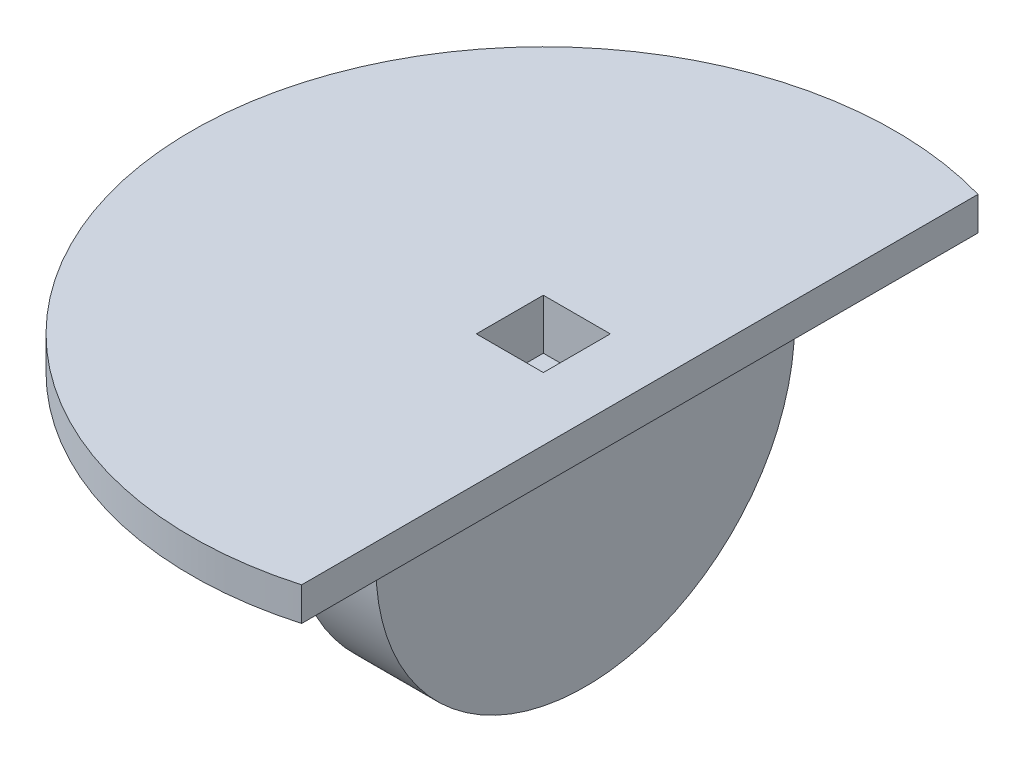
ISO-10303-21;
HEADER;
FILE_DESCRIPTION(('STEP AP214'),'2;1');
FILE_NAME('part.step','',(''),(''),'','','');
FILE_SCHEMA(('AUTOMOTIVE_DESIGN { 1 0 10303 214 1 1 1 1 }'));
ENDSEC;
DATA;
#1=APPLICATION_CONTEXT('core data for automotive mechanical design processes');
#2=APPLICATION_PROTOCOL_DEFINITION('international standard','automotive_design',2000,#1);
#3=PRODUCT_CONTEXT('',#1,'mechanical');
#4=PRODUCT('Part','Part','',(#3));
#5=PRODUCT_RELATED_PRODUCT_CATEGORY('part','',(#4));
#6=PRODUCT_DEFINITION_FORMATION('','',#4);
#7=PRODUCT_DEFINITION_CONTEXT('part definition',#1,'design');
#8=PRODUCT_DEFINITION('design','',#6,#7);
#9=PRODUCT_DEFINITION_SHAPE('','',#8);
#10=(LENGTH_UNIT() NAMED_UNIT(*) SI_UNIT(.MILLI.,.METRE.));
#11=(NAMED_UNIT(*) PLANE_ANGLE_UNIT() SI_UNIT($,.RADIAN.));
#12=(NAMED_UNIT(*) SI_UNIT($,.STERADIAN.) SOLID_ANGLE_UNIT());
#13=UNCERTAINTY_MEASURE_WITH_UNIT(LENGTH_MEASURE(1.E-05),#10,'distance_accuracy_value','');
#14=(GEOMETRIC_REPRESENTATION_CONTEXT(3) GLOBAL_UNCERTAINTY_ASSIGNED_CONTEXT((#13)) GLOBAL_UNIT_ASSIGNED_CONTEXT((#10,
#11,#12)) REPRESENTATION_CONTEXT('',''));
#15=CARTESIAN_POINT('',(0.,0.,0.));
#16=DIRECTION('',(0.,0.,1.));
#17=DIRECTION('',(1.,0.,0.));
#18=AXIS2_PLACEMENT_3D('',#15,#16,#17);
#19=CARTESIAN_POINT('',(-2.5,-2.5,0.));
#20=DIRECTION('',(1.,0.,0.));
#21=DIRECTION('',(0.,0.,-1.));
#22=AXIS2_PLACEMENT_3D('',#19,#20,#21);
#23=CYLINDRICAL_SURFACE('',#22,12.5);
#24=DIRECTION('',(1.,0.,0.));
#25=VECTOR('',#24,1.);
#26=CARTESIAN_POINT('',(2.5,-2.5,12.5));
#27=LINE('',#26,#25);
#28=CARTESIAN_POINT('',(-2.5,-2.5,12.5));
#29=VERTEX_POINT('',#28);
#30=CARTESIAN_POINT('',(2.5,-2.5,12.5));
#31=VERTEX_POINT('',#30);
#32=EDGE_CURVE('E184',#29,#31,#27,.T.);
#33=ORIENTED_EDGE('',*,*,#32,.F.);
#34=CARTESIAN_POINT('',(-2.5,-2.5,0.));
#35=DIRECTION('',(-1.,0.,0.));
#36=DIRECTION('',(0.,0.,1.));
#37=AXIS2_PLACEMENT_3D('',#34,#35,#36);
#38=CIRCLE('',#37,12.5);
#39=CARTESIAN_POINT('',(-2.5,-2.5,-12.5));
#40=VERTEX_POINT('',#39);
#41=EDGE_CURVE('E43',#40,#29,#38,.T.);
#42=ORIENTED_EDGE('',*,*,#41,.F.);
#43=DIRECTION('',(1.,0.,0.));
#44=VECTOR('',#43,1.);
#45=CARTESIAN_POINT('',(2.5,-2.5,-12.5));
#46=LINE('',#45,#44);
#47=CARTESIAN_POINT('',(2.5,-2.5,-12.5));
#48=VERTEX_POINT('',#47);
#49=EDGE_CURVE('E187',#48,#40,#46,.F.);
#50=ORIENTED_EDGE('',*,*,#49,.F.);
#51=CARTESIAN_POINT('',(2.5,-2.5,0.));
#52=DIRECTION('',(1.,0.,0.));
#53=DIRECTION('',(0.,0.,-1.));
#54=AXIS2_PLACEMENT_3D('',#51,#52,#53);
#55=CIRCLE('',#54,12.5);
#56=EDGE_CURVE('E11',#31,#48,#55,.T.);
#57=ORIENTED_EDGE('',*,*,#56,.F.);
#58=EDGE_LOOP('',(#33,#42,#50,#57));
#59=FACE_BOUND('',#58,.T.);
#60=ADVANCED_FACE('F35',(#59),#23,.T.);
#61=CARTESIAN_POINT('',(0.,2.,0.));
#62=DIRECTION('',(0.,-1.,0.));
#63=DIRECTION('',(0.,0.,-1.));
#64=AXIS2_PLACEMENT_3D('',#61,#62,#63);
#65=CYLINDRICAL_SURFACE('',#64,21.);
#66=CARTESIAN_POINT('',(0.,0.,0.));
#67=DIRECTION('',(0.,1.,0.));
#68=DIRECTION('',(0.,0.,1.));
#69=AXIS2_PLACEMENT_3D('',#66,#67,#68);
#70=CIRCLE('',#69,21.);
#71=CARTESIAN_POINT('',(5.76040185571511,0.,-20.1944985196631));
#72=VERTEX_POINT('',#71);
#73=CARTESIAN_POINT('',(5.76040185571511,0.,20.1944985196631));
#74=VERTEX_POINT('',#73);
#75=EDGE_CURVE('E164',#72,#74,#70,.T.);
#76=ORIENTED_EDGE('',*,*,#75,.T.);
#77=DIRECTION('',(0.,-1.,0.));
#78=VECTOR('',#77,1.);
#79=CARTESIAN_POINT('',(5.76040185571511,2.,20.1944985196631));
#80=LINE('',#79,#78);
#81=CARTESIAN_POINT('',(5.76040185571511,2.,20.1944985196631));
#82=VERTEX_POINT('',#81);
#83=EDGE_CURVE('E182',#82,#74,#80,.T.);
#84=ORIENTED_EDGE('',*,*,#83,.F.);
#85=CARTESIAN_POINT('',(0.,2.,0.));
#86=DIRECTION('',(0.,1.,0.));
#87=DIRECTION('',(0.,0.,1.));
#88=AXIS2_PLACEMENT_3D('',#85,#86,#87);
#89=CIRCLE('',#88,21.);
#90=CARTESIAN_POINT('',(5.76040185571511,2.,-20.1944985196631));
#91=VERTEX_POINT('',#90);
#92=EDGE_CURVE('E170',#91,#82,#89,.T.);
#93=ORIENTED_EDGE('',*,*,#92,.F.);
#94=DIRECTION('',(0.,-1.,0.));
#95=VECTOR('',#94,1.);
#96=CARTESIAN_POINT('',(5.76040185571511,2.,-20.1944985196631));
#97=LINE('',#96,#95);
#98=EDGE_CURVE('E176',#91,#72,#97,.T.);
#99=ORIENTED_EDGE('',*,*,#98,.T.);
#100=EDGE_LOOP('',(#76,#84,#93,#99));
#101=FACE_BOUND('',#100,.T.);
#102=ADVANCED_FACE('F219',(#101),#65,.T.);
#103=CARTESIAN_POINT('',(5.76040185571511,2.,-20.1944985196631));
#104=DIRECTION('',(1.,0.,0.));
#105=DIRECTION('',(0.,0.,-1.));
#106=AXIS2_PLACEMENT_3D('',#103,#104,#105);
#107=PLANE('',#106);
#108=DIRECTION('',(0.,0.,1.));
#109=VECTOR('',#108,1.);
#110=CARTESIAN_POINT('',(5.76040185571511,0.,-20.1944985196631));
#111=LINE('',#110,#109);
#112=EDGE_CURVE('E173',#72,#74,#111,.T.);
#113=ORIENTED_EDGE('',*,*,#112,.F.);
#114=ORIENTED_EDGE('',*,*,#98,.F.);
#115=DIRECTION('',(0.,0.,1.));
#116=VECTOR('',#115,1.);
#117=CARTESIAN_POINT('',(5.76040185571511,2.,-20.1944985196631));
#118=LINE('',#117,#116);
#119=EDGE_CURVE('E172',#91,#82,#118,.T.);
#120=ORIENTED_EDGE('',*,*,#119,.T.);
#121=ORIENTED_EDGE('',*,*,#83,.T.);
#122=EDGE_LOOP('',(#113,#114,#120,#121));
#123=FACE_BOUND('',#122,.T.);
#124=ADVANCED_FACE('F223',(#123),#107,.T.);
#125=CARTESIAN_POINT('',(0.,2.,0.));
#126=DIRECTION('',(0.,1.,0.));
#127=DIRECTION('',(0.,0.,1.));
#128=AXIS2_PLACEMENT_3D('',#125,#126,#127);
#129=PLANE('',#128);
#130=DIRECTION('',(0.,0.,1.));
#131=VECTOR('',#130,1.);
#132=CARTESIAN_POINT('',(-2.,2.,-2.));
#133=LINE('',#132,#131);
#134=CARTESIAN_POINT('',(-2.,2.,-2.));
#135=VERTEX_POINT('',#134);
#136=CARTESIAN_POINT('',(-2.,2.,2.));
#137=VERTEX_POINT('',#136);
#138=EDGE_CURVE('E50',#135,#137,#133,.T.);
#139=ORIENTED_EDGE('',*,*,#138,.F.);
#140=DIRECTION('',(-1.,0.,0.));
#141=VECTOR('',#140,1.);
#142=CARTESIAN_POINT('',(-2.,2.,-2.));
#143=LINE('',#142,#141);
#144=CARTESIAN_POINT('',(2.,2.,-2.));
#145=VERTEX_POINT('',#144);
#146=EDGE_CURVE('E131',#145,#135,#143,.T.);
#147=ORIENTED_EDGE('',*,*,#146,.F.);
#148=DIRECTION('',(0.,0.,-1.));
#149=VECTOR('',#148,1.);
#150=CARTESIAN_POINT('',(2.,2.,-2.));
#151=LINE('',#150,#149);
#152=CARTESIAN_POINT('',(2.,2.,2.));
#153=VERTEX_POINT('',#152);
#154=EDGE_CURVE('E134',#153,#145,#151,.T.);
#155=ORIENTED_EDGE('',*,*,#154,.F.);
#156=DIRECTION('',(1.,0.,0.));
#157=VECTOR('',#156,1.);
#158=CARTESIAN_POINT('',(-2.,2.,2.));
#159=LINE('',#158,#157);
#160=EDGE_CURVE('E140',#137,#153,#159,.T.);
#161=ORIENTED_EDGE('',*,*,#160,.F.);
#162=EDGE_LOOP('',(#139,#147,#155,#161));
#163=FACE_BOUND('',#162,.T.);
#164=ORIENTED_EDGE('',*,*,#92,.T.);
#165=ORIENTED_EDGE('',*,*,#119,.F.);
#166=EDGE_LOOP('',(#164,#165));
#167=FACE_BOUND('',#166,.T.);
#168=ADVANCED_FACE('F214',(#163,#167),#129,.T.);
#169=CARTESIAN_POINT('',(0.,0.,0.));
#170=DIRECTION('',(0.,1.,0.));
#171=DIRECTION('',(0.,0.,1.));
#172=AXIS2_PLACEMENT_3D('',#169,#170,#171);
#173=PLANE('',#172);
#174=DIRECTION('',(1.,0.,0.));
#175=VECTOR('',#174,1.);
#176=CARTESIAN_POINT('',(2.5,0.,12.5));
#177=LINE('',#176,#175);
#178=CARTESIAN_POINT('',(-2.5,0.,12.5));
#179=VERTEX_POINT('',#178);
#180=CARTESIAN_POINT('',(2.5,0.,12.5));
#181=VERTEX_POINT('',#180);
#182=EDGE_CURVE('E158',#179,#181,#177,.T.);
#183=ORIENTED_EDGE('',*,*,#182,.T.);
#184=DIRECTION('',(0.,0.,-1.));
#185=VECTOR('',#184,1.);
#186=CARTESIAN_POINT('',(2.5,0.,-12.5));
#187=LINE('',#186,#185);
#188=CARTESIAN_POINT('',(2.5,0.,-12.5));
#189=VERTEX_POINT('',#188);
#190=EDGE_CURVE('E146',#181,#189,#187,.T.);
#191=ORIENTED_EDGE('',*,*,#190,.T.);
#192=DIRECTION('',(-1.,0.,0.));
#193=VECTOR('',#192,1.);
#194=CARTESIAN_POINT('',(2.5,0.,-12.5));
#195=LINE('',#194,#193);
#196=CARTESIAN_POINT('',(-2.5,0.,-12.5));
#197=VERTEX_POINT('',#196);
#198=EDGE_CURVE('E152',#189,#197,#195,.T.);
#199=ORIENTED_EDGE('',*,*,#198,.T.);
#200=DIRECTION('',(0.,0.,1.));
#201=VECTOR('',#200,1.);
#202=CARTESIAN_POINT('',(-2.5,0.,-12.5));
#203=LINE('',#202,#201);
#204=EDGE_CURVE('E155',#197,#179,#203,.T.);
#205=ORIENTED_EDGE('',*,*,#204,.T.);
#206=EDGE_LOOP('',(#183,#191,#199,#205));
#207=FACE_BOUND('',#206,.T.);
#208=ORIENTED_EDGE('',*,*,#75,.F.);
#209=ORIENTED_EDGE('',*,*,#112,.T.);
#210=EDGE_LOOP('',(#208,#209));
#211=FACE_BOUND('',#210,.T.);
#212=ADVANCED_FACE('F199',(#207,#211),#173,.F.);
#213=CARTESIAN_POINT('',(2.5,-15.,-12.5));
#214=DIRECTION('',(1.,0.,0.));
#215=DIRECTION('',(0.,0.,-1.));
#216=AXIS2_PLACEMENT_3D('',#213,#214,#215);
#217=PLANE('',#216);
#218=DIRECTION('',(0.,1.,0.));
#219=VECTOR('',#218,1.);
#220=CARTESIAN_POINT('',(2.5,-15.,12.5));
#221=LINE('',#220,#219);
#222=EDGE_CURVE('E162',#31,#181,#221,.T.);
#223=ORIENTED_EDGE('',*,*,#222,.F.);
#224=ORIENTED_EDGE('',*,*,#56,.T.);
#225=DIRECTION('',(0.,1.,0.));
#226=VECTOR('',#225,1.);
#227=CARTESIAN_POINT('',(2.5,-15.,-12.5));
#228=LINE('',#227,#226);
#229=EDGE_CURVE('E161',#48,#189,#228,.T.);
#230=ORIENTED_EDGE('',*,*,#229,.T.);
#231=ORIENTED_EDGE('',*,*,#190,.F.);
#232=EDGE_LOOP('',(#223,#224,#230,#231));
#233=FACE_BOUND('',#232,.T.);
#234=ADVANCED_FACE('F206',(#233),#217,.T.);
#235=CARTESIAN_POINT('',(2.5,-15.,12.5));
#236=DIRECTION('',(0.,0.,1.));
#237=DIRECTION('',(1.,0.,0.));
#238=AXIS2_PLACEMENT_3D('',#235,#236,#237);
#239=PLANE('',#238);
#240=DIRECTION('',(0.,1.,0.));
#241=VECTOR('',#240,1.);
#242=CARTESIAN_POINT('',(-2.5,-15.,12.5));
#243=LINE('',#242,#241);
#244=EDGE_CURVE('E165',#29,#179,#243,.T.);
#245=ORIENTED_EDGE('',*,*,#244,.F.);
#246=ORIENTED_EDGE('',*,*,#32,.T.);
#247=ORIENTED_EDGE('',*,*,#222,.T.);
#248=ORIENTED_EDGE('',*,*,#182,.F.);
#249=EDGE_LOOP('',(#245,#246,#247,#248));
#250=FACE_BOUND('',#249,.T.);
#251=ADVANCED_FACE('F196',(#250),#239,.T.);
#252=CARTESIAN_POINT('',(-2.5,-15.,-12.5));
#253=DIRECTION('',(-1.,0.,0.));
#254=DIRECTION('',(0.,0.,1.));
#255=AXIS2_PLACEMENT_3D('',#252,#253,#254);
#256=PLANE('',#255);
#257=DIRECTION('',(0.,1.,0.));
#258=VECTOR('',#257,1.);
#259=CARTESIAN_POINT('',(-2.5,-15.,-12.5));
#260=LINE('',#259,#258);
#261=EDGE_CURVE('E167',#40,#197,#260,.T.);
#262=ORIENTED_EDGE('',*,*,#261,.F.);
#263=ORIENTED_EDGE('',*,*,#41,.T.);
#264=ORIENTED_EDGE('',*,*,#244,.T.);
#265=ORIENTED_EDGE('',*,*,#204,.F.);
#266=EDGE_LOOP('',(#262,#263,#264,#265));
#267=FACE_BOUND('',#266,.T.);
#268=ADVANCED_FACE('F190',(#267),#256,.T.);
#269=CARTESIAN_POINT('',(2.5,-15.,-12.5));
#270=DIRECTION('',(0.,0.,-1.));
#271=DIRECTION('',(-1.,0.,0.));
#272=AXIS2_PLACEMENT_3D('',#269,#270,#271);
#273=PLANE('',#272);
#274=ORIENTED_EDGE('',*,*,#229,.F.);
#275=ORIENTED_EDGE('',*,*,#49,.T.);
#276=ORIENTED_EDGE('',*,*,#261,.T.);
#277=ORIENTED_EDGE('',*,*,#198,.F.);
#278=EDGE_LOOP('',(#274,#275,#276,#277));
#279=FACE_BOUND('',#278,.T.);
#280=ADVANCED_FACE('F204',(#279),#273,.T.);
#281=CARTESIAN_POINT('',(-2.,-1.,-2.));
#282=DIRECTION('',(-1.,0.,0.));
#283=DIRECTION('',(0.,0.,1.));
#284=AXIS2_PLACEMENT_3D('',#281,#282,#283);
#285=PLANE('',#284);
#286=ORIENTED_EDGE('',*,*,#138,.T.);
#287=DIRECTION('',(0.,1.,0.));
#288=VECTOR('',#287,1.);
#289=CARTESIAN_POINT('',(-2.,-1.,2.));
#290=LINE('',#289,#288);
#291=CARTESIAN_POINT('',(-2.,-1.,2.));
#292=VERTEX_POINT('',#291);
#293=EDGE_CURVE('E109',#292,#137,#290,.T.);
#294=ORIENTED_EDGE('',*,*,#293,.F.);
#295=DIRECTION('',(0.,0.,1.));
#296=VECTOR('',#295,1.);
#297=CARTESIAN_POINT('',(-2.,-1.,-2.));
#298=LINE('',#297,#296);
#299=CARTESIAN_POINT('',(-2.,-1.,-2.));
#300=VERTEX_POINT('',#299);
#301=EDGE_CURVE('E113',#300,#292,#298,.T.);
#302=ORIENTED_EDGE('',*,*,#301,.F.);
#303=DIRECTION('',(0.,1.,0.));
#304=VECTOR('',#303,1.);
#305=CARTESIAN_POINT('',(-2.,-1.,-2.));
#306=LINE('',#305,#304);
#307=EDGE_CURVE('E144',#300,#135,#306,.T.);
#308=ORIENTED_EDGE('',*,*,#307,.T.);
#309=EDGE_LOOP('',(#286,#294,#302,#308));
#310=FACE_BOUND('',#309,.T.);
#311=ADVANCED_FACE('F111',(#310),#285,.F.);
#312=CARTESIAN_POINT('',(-2.,-1.,-2.));
#313=DIRECTION('',(0.,0.,-1.));
#314=DIRECTION('',(-1.,0.,0.));
#315=AXIS2_PLACEMENT_3D('',#312,#313,#314);
#316=PLANE('',#315);
#317=ORIENTED_EDGE('',*,*,#146,.T.);
#318=ORIENTED_EDGE('',*,*,#307,.F.);
#319=DIRECTION('',(-1.,0.,0.));
#320=VECTOR('',#319,1.);
#321=CARTESIAN_POINT('',(-2.,-1.,-2.));
#322=LINE('',#321,#320);
#323=CARTESIAN_POINT('',(2.,-1.,-2.));
#324=VERTEX_POINT('',#323);
#325=EDGE_CURVE('E119',#324,#300,#322,.T.);
#326=ORIENTED_EDGE('',*,*,#325,.F.);
#327=DIRECTION('',(0.,1.,0.));
#328=VECTOR('',#327,1.);
#329=CARTESIAN_POINT('',(2.,-1.,-2.));
#330=LINE('',#329,#328);
#331=EDGE_CURVE('E147',#324,#145,#330,.T.);
#332=ORIENTED_EDGE('',*,*,#331,.T.);
#333=EDGE_LOOP('',(#317,#318,#326,#332));
#334=FACE_BOUND('',#333,.T.);
#335=ADVANCED_FACE('F245',(#334),#316,.F.);
#336=CARTESIAN_POINT('',(2.,-1.,-2.));
#337=DIRECTION('',(1.,0.,0.));
#338=DIRECTION('',(0.,0.,-1.));
#339=AXIS2_PLACEMENT_3D('',#336,#337,#338);
#340=PLANE('',#339);
#341=ORIENTED_EDGE('',*,*,#154,.T.);
#342=ORIENTED_EDGE('',*,*,#331,.F.);
#343=DIRECTION('',(0.,0.,-1.));
#344=VECTOR('',#343,1.);
#345=CARTESIAN_POINT('',(2.,-1.,-2.));
#346=LINE('',#345,#344);
#347=CARTESIAN_POINT('',(2.,-1.,2.));
#348=VERTEX_POINT('',#347);
#349=EDGE_CURVE('E127',#348,#324,#346,.T.);
#350=ORIENTED_EDGE('',*,*,#349,.F.);
#351=DIRECTION('',(0.,1.,0.));
#352=VECTOR('',#351,1.);
#353=CARTESIAN_POINT('',(2.,-1.,2.));
#354=LINE('',#353,#352);
#355=EDGE_CURVE('E118',#348,#153,#354,.T.);
#356=ORIENTED_EDGE('',*,*,#355,.T.);
#357=EDGE_LOOP('',(#341,#342,#350,#356));
#358=FACE_BOUND('',#357,.T.);
#359=ADVANCED_FACE('F243',(#358),#340,.F.);
#360=CARTESIAN_POINT('',(-2.,-1.,2.));
#361=DIRECTION('',(0.,0.,1.));
#362=DIRECTION('',(1.,0.,0.));
#363=AXIS2_PLACEMENT_3D('',#360,#361,#362);
#364=PLANE('',#363);
#365=ORIENTED_EDGE('',*,*,#160,.T.);
#366=ORIENTED_EDGE('',*,*,#355,.F.);
#367=DIRECTION('',(1.,0.,0.));
#368=VECTOR('',#367,1.);
#369=CARTESIAN_POINT('',(-2.,-1.,2.));
#370=LINE('',#369,#368);
#371=EDGE_CURVE('E122',#292,#348,#370,.T.);
#372=ORIENTED_EDGE('',*,*,#371,.F.);
#373=ORIENTED_EDGE('',*,*,#293,.T.);
#374=EDGE_LOOP('',(#365,#366,#372,#373));
#375=FACE_BOUND('',#374,.T.);
#376=ADVANCED_FACE('F123',(#375),#364,.F.);
#377=CARTESIAN_POINT('',(0.,-1.,0.));
#378=DIRECTION('',(0.,1.,0.));
#379=DIRECTION('',(0.,0.,1.));
#380=AXIS2_PLACEMENT_3D('',#377,#378,#379);
#381=PLANE('',#380);
#382=ORIENTED_EDGE('',*,*,#301,.T.);
#383=ORIENTED_EDGE('',*,*,#371,.T.);
#384=ORIENTED_EDGE('',*,*,#349,.T.);
#385=ORIENTED_EDGE('',*,*,#325,.T.);
#386=EDGE_LOOP('',(#382,#383,#384,#385));
#387=FACE_BOUND('',#386,.T.);
#388=ADVANCED_FACE('F129',(#387),#381,.T.);
#389=CLOSED_SHELL('',(#60,#102,#124,#168,#212,#234,#251,#268,#280,#311,#335,#359,#376,#388));
#390=MANIFOLD_SOLID_BREP('B2',#389);
#391=ADVANCED_BREP_SHAPE_REPRESENTATION('',(#18,#390),#14);
#392=SHAPE_DEFINITION_REPRESENTATION(#9,#391);
ENDSEC;
END-ISO-10303-21;
